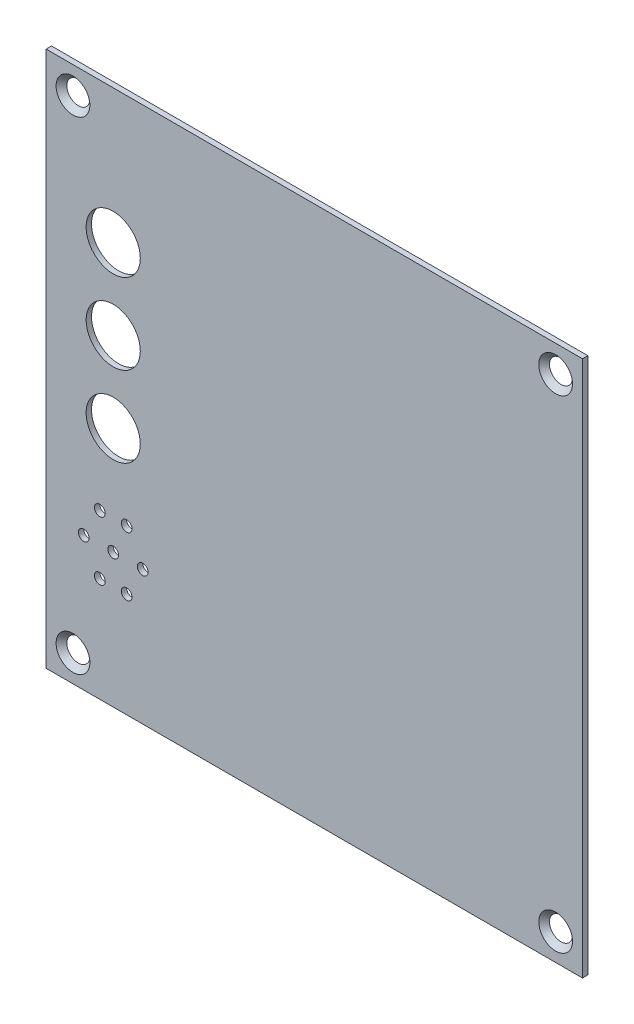
ISO-10303-21;
HEADER;
FILE_DESCRIPTION(('STEP AP214'),'2;1');
FILE_NAME('part.step','',(''),(''),'','','');
FILE_SCHEMA(('AUTOMOTIVE_DESIGN { 1 0 10303 214 1 1 1 1 }'));
ENDSEC;
DATA;
#1=APPLICATION_CONTEXT('core data for automotive mechanical design processes');
#2=APPLICATION_PROTOCOL_DEFINITION('international standard','automotive_design',2000,#1);
#3=PRODUCT_CONTEXT('',#1,'mechanical');
#4=PRODUCT('Part','Part','',(#3));
#5=PRODUCT_RELATED_PRODUCT_CATEGORY('part','',(#4));
#6=PRODUCT_DEFINITION_FORMATION('','',#4);
#7=PRODUCT_DEFINITION_CONTEXT('part definition',#1,'design');
#8=PRODUCT_DEFINITION('design','',#6,#7);
#9=PRODUCT_DEFINITION_SHAPE('','',#8);
#10=(LENGTH_UNIT() NAMED_UNIT(*) SI_UNIT(.MILLI.,.METRE.));
#11=(NAMED_UNIT(*) PLANE_ANGLE_UNIT() SI_UNIT($,.RADIAN.));
#12=(NAMED_UNIT(*) SI_UNIT($,.STERADIAN.) SOLID_ANGLE_UNIT());
#13=UNCERTAINTY_MEASURE_WITH_UNIT(LENGTH_MEASURE(1.E-05),#10,'distance_accuracy_value','');
#14=(GEOMETRIC_REPRESENTATION_CONTEXT(3) GLOBAL_UNCERTAINTY_ASSIGNED_CONTEXT((#13)) GLOBAL_UNIT_ASSIGNED_CONTEXT((#10,
#11,#12)) REPRESENTATION_CONTEXT('',''));
#15=CARTESIAN_POINT('',(0.,0.,0.));
#16=DIRECTION('',(0.,0.,1.));
#17=DIRECTION('',(1.,0.,0.));
#18=AXIS2_PLACEMENT_3D('',#15,#16,#17);
#19=CARTESIAN_POINT('',(0.,0.,0.));
#20=DIRECTION('',(0.,0.,-1.));
#21=DIRECTION('',(-1.,0.,0.));
#22=AXIS2_PLACEMENT_3D('',#19,#20,#21);
#23=PLANE('',#22);
#24=CARTESIAN_POINT('',(12.5,75.,0.));
#25=DIRECTION('',(0.,0.,1.));
#26=DIRECTION('',(1.,0.,0.));
#27=AXIS2_PLACEMENT_3D('',#24,#25,#26);
#28=CIRCLE('',#27,5.05);
#29=CARTESIAN_POINT('',(17.55,75.,0.));
#30=VERTEX_POINT('',#29);
#31=EDGE_CURVE('E132',#30,#30,#28,.T.);
#32=ORIENTED_EDGE('',*,*,#31,.T.);
#33=EDGE_LOOP('',(#32));
#34=FACE_BOUND('',#33,.T.);
#35=CARTESIAN_POINT('',(18.,25.,0.));
#36=DIRECTION('',(0.,0.,1.));
#37=DIRECTION('',(1.,0.,0.));
#38=AXIS2_PLACEMENT_3D('',#35,#36,#37);
#39=CIRCLE('',#38,1.);
#40=CARTESIAN_POINT('',(19.,25.,0.));
#41=VERTEX_POINT('',#40);
#42=EDGE_CURVE('E158',#41,#41,#39,.T.);
#43=ORIENTED_EDGE('',*,*,#42,.T.);
#44=EDGE_LOOP('',(#43));
#45=FACE_BOUND('',#44,.T.);
#46=CARTESIAN_POINT('',(9.99999999999999,30.5,0.));
#47=DIRECTION('',(0.,0.,1.));
#48=DIRECTION('',(1.,0.,0.));
#49=AXIS2_PLACEMENT_3D('',#46,#47,#48);
#50=CIRCLE('',#49,1.);
#51=CARTESIAN_POINT('',(11.,30.5,0.));
#52=VERTEX_POINT('',#51);
#53=EDGE_CURVE('E169',#52,#52,#50,.T.);
#54=ORIENTED_EDGE('',*,*,#53,.T.);
#55=EDGE_LOOP('',(#54));
#56=FACE_BOUND('',#55,.T.);
#57=CARTESIAN_POINT('',(15.,30.5,0.));
#58=DIRECTION('',(0.,0.,1.));
#59=DIRECTION('',(1.,0.,0.));
#60=AXIS2_PLACEMENT_3D('',#57,#58,#59);
#61=CIRCLE('',#60,1.);
#62=CARTESIAN_POINT('',(16.,30.5,0.));
#63=VERTEX_POINT('',#62);
#64=EDGE_CURVE('E170',#63,#63,#61,.T.);
#65=ORIENTED_EDGE('',*,*,#64,.T.);
#66=EDGE_LOOP('',(#65));
#67=FACE_BOUND('',#66,.T.);
#68=CARTESIAN_POINT('',(15.,19.5,0.));
#69=DIRECTION('',(0.,0.,1.));
#70=DIRECTION('',(1.,0.,0.));
#71=AXIS2_PLACEMENT_3D('',#68,#69,#70);
#72=CIRCLE('',#71,1.);
#73=CARTESIAN_POINT('',(16.,19.5,0.));
#74=VERTEX_POINT('',#73);
#75=EDGE_CURVE('E180',#74,#74,#72,.T.);
#76=ORIENTED_EDGE('',*,*,#75,.T.);
#77=EDGE_LOOP('',(#76));
#78=FACE_BOUND('',#77,.T.);
#79=CARTESIAN_POINT('',(12.5,45.,0.));
#80=DIRECTION('',(0.,0.,1.));
#81=DIRECTION('',(1.,0.,0.));
#82=AXIS2_PLACEMENT_3D('',#79,#80,#81);
#83=CIRCLE('',#82,5.05);
#84=CARTESIAN_POINT('',(17.55,45.,0.));
#85=VERTEX_POINT('',#84);
#86=EDGE_CURVE('E150',#85,#85,#83,.T.);
#87=ORIENTED_EDGE('',*,*,#86,.T.);
#88=EDGE_LOOP('',(#87));
#89=FACE_BOUND('',#88,.T.);
#90=CARTESIAN_POINT('',(12.5,25.,0.));
#91=DIRECTION('',(0.,0.,1.));
#92=DIRECTION('',(1.,0.,0.));
#93=AXIS2_PLACEMENT_3D('',#90,#91,#92);
#94=CIRCLE('',#93,1.);
#95=CARTESIAN_POINT('',(13.5,25.,0.));
#96=VERTEX_POINT('',#95);
#97=EDGE_CURVE('E143',#96,#96,#94,.T.);
#98=ORIENTED_EDGE('',*,*,#97,.T.);
#99=EDGE_LOOP('',(#98));
#100=FACE_BOUND('',#99,.T.);
#101=CARTESIAN_POINT('',(9.99999999999999,19.5,0.));
#102=DIRECTION('',(0.,0.,1.));
#103=DIRECTION('',(1.,0.,0.));
#104=AXIS2_PLACEMENT_3D('',#101,#102,#103);
#105=CIRCLE('',#104,1.);
#106=CARTESIAN_POINT('',(11.,19.5,0.));
#107=VERTEX_POINT('',#106);
#108=EDGE_CURVE('E144',#107,#107,#105,.T.);
#109=ORIENTED_EDGE('',*,*,#108,.T.);
#110=EDGE_LOOP('',(#109));
#111=FACE_BOUND('',#110,.T.);
#112=CARTESIAN_POINT('',(6.99999999999999,25.,0.));
#113=DIRECTION('',(0.,0.,1.));
#114=DIRECTION('',(1.,0.,0.));
#115=AXIS2_PLACEMENT_3D('',#112,#113,#114);
#116=CIRCLE('',#115,1.);
#117=CARTESIAN_POINT('',(7.99999999999999,25.,0.));
#118=VERTEX_POINT('',#117);
#119=EDGE_CURVE('E157',#118,#118,#116,.T.);
#120=ORIENTED_EDGE('',*,*,#119,.T.);
#121=EDGE_LOOP('',(#120));
#122=FACE_BOUND('',#121,.T.);
#123=CARTESIAN_POINT('',(12.5,60.,0.));
#124=DIRECTION('',(0.,0.,1.));
#125=DIRECTION('',(1.,0.,0.));
#126=AXIS2_PLACEMENT_3D('',#123,#124,#125);
#127=CIRCLE('',#126,5.05);
#128=CARTESIAN_POINT('',(17.55,60.,0.));
#129=VERTEX_POINT('',#128);
#130=EDGE_CURVE('E136',#129,#129,#127,.T.);
#131=ORIENTED_EDGE('',*,*,#130,.T.);
#132=EDGE_LOOP('',(#131));
#133=FACE_BOUND('',#132,.T.);
#134=CARTESIAN_POINT('',(4.99999999999999,95.,0.));
#135=DIRECTION('',(0.,0.,-1.));
#136=DIRECTION('',(-1.,0.,0.));
#137=AXIS2_PLACEMENT_3D('',#134,#135,#136);
#138=CIRCLE('',#137,2.15);
#139=CARTESIAN_POINT('',(2.84999999999999,95.,0.));
#140=VERTEX_POINT('',#139);
#141=EDGE_CURVE('E126',#140,#140,#138,.T.);
#142=ORIENTED_EDGE('',*,*,#141,.F.);
#143=EDGE_LOOP('',(#142));
#144=FACE_BOUND('',#143,.T.);
#145=CARTESIAN_POINT('',(95.,5.,0.));
#146=DIRECTION('',(0.,0.,-1.));
#147=DIRECTION('',(-1.,0.,0.));
#148=AXIS2_PLACEMENT_3D('',#145,#146,#147);
#149=CIRCLE('',#148,2.15);
#150=CARTESIAN_POINT('',(92.85,5.,0.));
#151=VERTEX_POINT('',#150);
#152=EDGE_CURVE('E110',#151,#151,#149,.T.);
#153=ORIENTED_EDGE('',*,*,#152,.F.);
#154=EDGE_LOOP('',(#153));
#155=FACE_BOUND('',#154,.T.);
#156=CARTESIAN_POINT('',(5.,5.,0.));
#157=DIRECTION('',(0.,0.,-1.));
#158=DIRECTION('',(-1.,0.,0.));
#159=AXIS2_PLACEMENT_3D('',#156,#157,#158);
#160=CIRCLE('',#159,2.15);
#161=CARTESIAN_POINT('',(2.85,5.,0.));
#162=VERTEX_POINT('',#161);
#163=EDGE_CURVE('E102',#162,#162,#160,.T.);
#164=ORIENTED_EDGE('',*,*,#163,.F.);
#165=EDGE_LOOP('',(#164));
#166=FACE_BOUND('',#165,.T.);
#167=DIRECTION('',(0.,-1.,0.));
#168=VECTOR('',#167,1.);
#169=CARTESIAN_POINT('',(0.,0.,0.));
#170=LINE('',#169,#168);
#171=CARTESIAN_POINT('',(0.,100.,0.));
#172=VERTEX_POINT('',#171);
#173=CARTESIAN_POINT('',(0.,0.,0.));
#174=VERTEX_POINT('',#173);
#175=EDGE_CURVE('E99',#172,#174,#170,.T.);
#176=ORIENTED_EDGE('',*,*,#175,.F.);
#177=DIRECTION('',(-1.,0.,0.));
#178=VECTOR('',#177,1.);
#179=CARTESIAN_POINT('',(0.,100.,0.));
#180=LINE('',#179,#178);
#181=CARTESIAN_POINT('',(100.,100.,0.));
#182=VERTEX_POINT('',#181);
#183=EDGE_CURVE('E74',#182,#172,#180,.T.);
#184=ORIENTED_EDGE('',*,*,#183,.F.);
#185=DIRECTION('',(0.,1.,0.));
#186=VECTOR('',#185,1.);
#187=CARTESIAN_POINT('',(100.,0.,0.));
#188=LINE('',#187,#186);
#189=CARTESIAN_POINT('',(100.,0.,0.));
#190=VERTEX_POINT('',#189);
#191=EDGE_CURVE('E68',#190,#182,#188,.T.);
#192=ORIENTED_EDGE('',*,*,#191,.F.);
#193=DIRECTION('',(1.,0.,0.));
#194=VECTOR('',#193,1.);
#195=CARTESIAN_POINT('',(0.,0.,0.));
#196=LINE('',#195,#194);
#197=EDGE_CURVE('E90',#174,#190,#196,.T.);
#198=ORIENTED_EDGE('',*,*,#197,.F.);
#199=EDGE_LOOP('',(#176,#184,#192,#198));
#200=FACE_BOUND('',#199,.T.);
#201=CARTESIAN_POINT('',(95.,95.,0.));
#202=DIRECTION('',(0.,0.,-1.));
#203=DIRECTION('',(-1.,0.,0.));
#204=AXIS2_PLACEMENT_3D('',#201,#202,#203);
#205=CIRCLE('',#204,2.15);
#206=CARTESIAN_POINT('',(92.85,95.,0.));
#207=VERTEX_POINT('',#206);
#208=EDGE_CURVE('E36',#207,#207,#205,.T.);
#209=ORIENTED_EDGE('',*,*,#208,.F.);
#210=EDGE_LOOP('',(#209));
#211=FACE_BOUND('',#210,.T.);
#212=ADVANCED_FACE('F32',(#34,#45,#56,#67,#78,#89,#100,#111,#122,#133,#144,#155,#166,#200,#211),
#23,.T.);
#213=CARTESIAN_POINT('',(0.,0.,1.));
#214=DIRECTION('',(1.,0.,0.));
#215=DIRECTION('',(0.,1.,0.));
#216=AXIS2_PLACEMENT_3D('',#213,#214,#215);
#217=PLANE('',#216);
#218=ORIENTED_EDGE('',*,*,#175,.T.);
#219=DIRECTION('',(0.,0.,-1.));
#220=VECTOR('',#219,1.);
#221=CARTESIAN_POINT('',(0.,0.,1.));
#222=LINE('',#221,#220);
#223=CARTESIAN_POINT('',(0.,0.,1.));
#224=VERTEX_POINT('',#223);
#225=EDGE_CURVE('E11',#224,#174,#222,.T.);
#226=ORIENTED_EDGE('',*,*,#225,.F.);
#227=DIRECTION('',(0.,-1.,0.));
#228=VECTOR('',#227,1.);
#229=CARTESIAN_POINT('',(0.,0.,1.));
#230=LINE('',#229,#228);
#231=CARTESIAN_POINT('',(0.,100.,1.));
#232=VERTEX_POINT('',#231);
#233=EDGE_CURVE('E86',#232,#224,#230,.T.);
#234=ORIENTED_EDGE('',*,*,#233,.F.);
#235=DIRECTION('',(0.,0.,-1.));
#236=VECTOR('',#235,1.);
#237=CARTESIAN_POINT('',(0.,100.,1.));
#238=LINE('',#237,#236);
#239=EDGE_CURVE('E95',#232,#172,#238,.T.);
#240=ORIENTED_EDGE('',*,*,#239,.T.);
#241=EDGE_LOOP('',(#218,#226,#234,#240));
#242=FACE_BOUND('',#241,.T.);
#243=ADVANCED_FACE('F34',(#242),#217,.F.);
#244=CARTESIAN_POINT('',(0.,0.,1.));
#245=DIRECTION('',(0.,1.,0.));
#246=DIRECTION('',(0.,0.,1.));
#247=AXIS2_PLACEMENT_3D('',#244,#245,#246);
#248=PLANE('',#247);
#249=ORIENTED_EDGE('',*,*,#197,.T.);
#250=DIRECTION('',(0.,0.,-1.));
#251=VECTOR('',#250,1.);
#252=CARTESIAN_POINT('',(100.,0.,1.));
#253=LINE('',#252,#251);
#254=CARTESIAN_POINT('',(100.,0.,1.));
#255=VERTEX_POINT('',#254);
#256=EDGE_CURVE('E42',#255,#190,#253,.T.);
#257=ORIENTED_EDGE('',*,*,#256,.F.);
#258=DIRECTION('',(1.,0.,0.));
#259=VECTOR('',#258,1.);
#260=CARTESIAN_POINT('',(0.,0.,1.));
#261=LINE('',#260,#259);
#262=EDGE_CURVE('E81',#224,#255,#261,.T.);
#263=ORIENTED_EDGE('',*,*,#262,.F.);
#264=ORIENTED_EDGE('',*,*,#225,.T.);
#265=EDGE_LOOP('',(#249,#257,#263,#264));
#266=FACE_BOUND('',#265,.T.);
#267=ADVANCED_FACE('F89',(#266),#248,.F.);
#268=CARTESIAN_POINT('',(100.,0.,1.));
#269=DIRECTION('',(-1.,0.,0.));
#270=DIRECTION('',(0.,-1.,0.));
#271=AXIS2_PLACEMENT_3D('',#268,#269,#270);
#272=PLANE('',#271);
#273=ORIENTED_EDGE('',*,*,#191,.T.);
#274=DIRECTION('',(0.,0.,-1.));
#275=VECTOR('',#274,1.);
#276=CARTESIAN_POINT('',(100.,100.,1.));
#277=LINE('',#276,#275);
#278=CARTESIAN_POINT('',(100.,100.,1.));
#279=VERTEX_POINT('',#278);
#280=EDGE_CURVE('E91',#279,#182,#277,.T.);
#281=ORIENTED_EDGE('',*,*,#280,.F.);
#282=DIRECTION('',(0.,1.,0.));
#283=VECTOR('',#282,1.);
#284=CARTESIAN_POINT('',(100.,0.,1.));
#285=LINE('',#284,#283);
#286=EDGE_CURVE('E84',#255,#279,#285,.T.);
#287=ORIENTED_EDGE('',*,*,#286,.F.);
#288=ORIENTED_EDGE('',*,*,#256,.T.);
#289=EDGE_LOOP('',(#273,#281,#287,#288));
#290=FACE_BOUND('',#289,.T.);
#291=ADVANCED_FACE('F93',(#290),#272,.F.);
#292=CARTESIAN_POINT('',(0.,100.,1.));
#293=DIRECTION('',(0.,-1.,0.));
#294=DIRECTION('',(0.,0.,-1.));
#295=AXIS2_PLACEMENT_3D('',#292,#293,#294);
#296=PLANE('',#295);
#297=ORIENTED_EDGE('',*,*,#183,.T.);
#298=ORIENTED_EDGE('',*,*,#239,.F.);
#299=DIRECTION('',(-1.,0.,0.));
#300=VECTOR('',#299,1.);
#301=CARTESIAN_POINT('',(0.,100.,1.));
#302=LINE('',#301,#300);
#303=EDGE_CURVE('E51',#279,#232,#302,.T.);
#304=ORIENTED_EDGE('',*,*,#303,.F.);
#305=ORIENTED_EDGE('',*,*,#280,.T.);
#306=EDGE_LOOP('',(#297,#298,#304,#305));
#307=FACE_BOUND('',#306,.T.);
#308=ADVANCED_FACE('F205',(#307),#296,.F.);
#309=CARTESIAN_POINT('',(0.,0.,1.));
#310=DIRECTION('',(0.,0.,-1.));
#311=DIRECTION('',(-1.,0.,0.));
#312=AXIS2_PLACEMENT_3D('',#309,#310,#311);
#313=PLANE('',#312);
#314=CARTESIAN_POINT('',(12.5,75.,1.));
#315=DIRECTION('',(0.,0.,1.));
#316=DIRECTION('',(1.,0.,0.));
#317=AXIS2_PLACEMENT_3D('',#314,#315,#316);
#318=CIRCLE('',#317,5.05);
#319=CARTESIAN_POINT('',(17.55,75.,1.));
#320=VERTEX_POINT('',#319);
#321=EDGE_CURVE('E153',#320,#320,#318,.T.);
#322=ORIENTED_EDGE('',*,*,#321,.F.);
#323=EDGE_LOOP('',(#322));
#324=FACE_BOUND('',#323,.T.);
#325=CARTESIAN_POINT('',(18.,25.,1.));
#326=DIRECTION('',(0.,0.,1.));
#327=DIRECTION('',(1.,0.,0.));
#328=AXIS2_PLACEMENT_3D('',#325,#326,#327);
#329=CIRCLE('',#328,1.);
#330=CARTESIAN_POINT('',(19.,25.,1.));
#331=VERTEX_POINT('',#330);
#332=EDGE_CURVE('E173',#331,#331,#329,.T.);
#333=ORIENTED_EDGE('',*,*,#332,.F.);
#334=EDGE_LOOP('',(#333));
#335=FACE_BOUND('',#334,.T.);
#336=CARTESIAN_POINT('',(9.99999999999999,30.5,1.));
#337=DIRECTION('',(0.,0.,1.));
#338=DIRECTION('',(1.,0.,0.));
#339=AXIS2_PLACEMENT_3D('',#336,#337,#338);
#340=CIRCLE('',#339,1.);
#341=CARTESIAN_POINT('',(11.,30.5,1.));
#342=VERTEX_POINT('',#341);
#343=EDGE_CURVE('E166',#342,#342,#340,.T.);
#344=ORIENTED_EDGE('',*,*,#343,.F.);
#345=EDGE_LOOP('',(#344));
#346=FACE_BOUND('',#345,.T.);
#347=CARTESIAN_POINT('',(15.,30.5,1.));
#348=DIRECTION('',(0.,0.,1.));
#349=DIRECTION('',(1.,0.,0.));
#350=AXIS2_PLACEMENT_3D('',#347,#348,#349);
#351=CIRCLE('',#350,1.);
#352=CARTESIAN_POINT('',(16.,30.5,1.));
#353=VERTEX_POINT('',#352);
#354=EDGE_CURVE('E183',#353,#353,#351,.T.);
#355=ORIENTED_EDGE('',*,*,#354,.F.);
#356=EDGE_LOOP('',(#355));
#357=FACE_BOUND('',#356,.T.);
#358=CARTESIAN_POINT('',(15.,19.5,1.));
#359=DIRECTION('',(0.,0.,1.));
#360=DIRECTION('',(1.,0.,0.));
#361=AXIS2_PLACEMENT_3D('',#358,#359,#360);
#362=CIRCLE('',#361,1.);
#363=CARTESIAN_POINT('',(16.,19.5,1.));
#364=VERTEX_POINT('',#363);
#365=EDGE_CURVE('E139',#364,#364,#362,.T.);
#366=ORIENTED_EDGE('',*,*,#365,.F.);
#367=EDGE_LOOP('',(#366));
#368=FACE_BOUND('',#367,.T.);
#369=CARTESIAN_POINT('',(12.5,45.,1.));
#370=DIRECTION('',(0.,0.,1.));
#371=DIRECTION('',(1.,0.,0.));
#372=AXIS2_PLACEMENT_3D('',#369,#370,#371);
#373=CIRCLE('',#372,5.05);
#374=CARTESIAN_POINT('',(17.55,45.,1.));
#375=VERTEX_POINT('',#374);
#376=EDGE_CURVE('E147',#375,#375,#373,.T.);
#377=ORIENTED_EDGE('',*,*,#376,.F.);
#378=EDGE_LOOP('',(#377));
#379=FACE_BOUND('',#378,.T.);
#380=CARTESIAN_POINT('',(12.5,25.,1.));
#381=DIRECTION('',(0.,0.,1.));
#382=DIRECTION('',(1.,0.,0.));
#383=AXIS2_PLACEMENT_3D('',#380,#381,#382);
#384=CIRCLE('',#383,1.);
#385=CARTESIAN_POINT('',(13.5,25.,1.));
#386=VERTEX_POINT('',#385);
#387=EDGE_CURVE('E140',#386,#386,#384,.T.);
#388=ORIENTED_EDGE('',*,*,#387,.F.);
#389=EDGE_LOOP('',(#388));
#390=FACE_BOUND('',#389,.T.);
#391=CARTESIAN_POINT('',(9.99999999999999,19.5,1.));
#392=DIRECTION('',(0.,0.,1.));
#393=DIRECTION('',(1.,0.,0.));
#394=AXIS2_PLACEMENT_3D('',#391,#392,#393);
#395=CIRCLE('',#394,1.);
#396=CARTESIAN_POINT('',(11.,19.5,1.));
#397=VERTEX_POINT('',#396);
#398=EDGE_CURVE('E161',#397,#397,#395,.T.);
#399=ORIENTED_EDGE('',*,*,#398,.F.);
#400=EDGE_LOOP('',(#399));
#401=FACE_BOUND('',#400,.T.);
#402=CARTESIAN_POINT('',(6.99999999999999,25.,1.));
#403=DIRECTION('',(0.,0.,1.));
#404=DIRECTION('',(1.,0.,0.));
#405=AXIS2_PLACEMENT_3D('',#402,#403,#404);
#406=CIRCLE('',#405,1.);
#407=CARTESIAN_POINT('',(7.99999999999999,25.,1.));
#408=VERTEX_POINT('',#407);
#409=EDGE_CURVE('E154',#408,#408,#406,.T.);
#410=ORIENTED_EDGE('',*,*,#409,.F.);
#411=EDGE_LOOP('',(#410));
#412=FACE_BOUND('',#411,.T.);
#413=CARTESIAN_POINT('',(12.5,60.,1.));
#414=DIRECTION('',(0.,0.,1.));
#415=DIRECTION('',(1.,0.,0.));
#416=AXIS2_PLACEMENT_3D('',#413,#414,#415);
#417=CIRCLE('',#416,5.05);
#418=CARTESIAN_POINT('',(17.55,60.,1.));
#419=VERTEX_POINT('',#418);
#420=EDGE_CURVE('E133',#419,#419,#417,.T.);
#421=ORIENTED_EDGE('',*,*,#420,.F.);
#422=EDGE_LOOP('',(#421));
#423=FACE_BOUND('',#422,.T.);
#424=CARTESIAN_POINT('',(4.99999999999999,95.,1.));
#425=DIRECTION('',(0.,0.,1.));
#426=DIRECTION('',(1.,0.,0.));
#427=AXIS2_PLACEMENT_3D('',#424,#425,#426);
#428=CIRCLE('',#427,3.15);
#429=CARTESIAN_POINT('',(8.14999999999999,95.,1.));
#430=VERTEX_POINT('',#429);
#431=EDGE_CURVE('E129',#430,#430,#428,.T.);
#432=ORIENTED_EDGE('',*,*,#431,.F.);
#433=EDGE_LOOP('',(#432));
#434=FACE_BOUND('',#433,.T.);
#435=CARTESIAN_POINT('',(95.,95.,1.));
#436=DIRECTION('',(0.,0.,1.));
#437=DIRECTION('',(1.,0.,0.));
#438=AXIS2_PLACEMENT_3D('',#435,#436,#437);
#439=CIRCLE('',#438,3.15);
#440=CARTESIAN_POINT('',(98.15,95.,1.));
#441=VERTEX_POINT('',#440);
#442=EDGE_CURVE('E122',#441,#441,#439,.T.);
#443=ORIENTED_EDGE('',*,*,#442,.F.);
#444=EDGE_LOOP('',(#443));
#445=FACE_BOUND('',#444,.T.);
#446=CARTESIAN_POINT('',(95.,5.,1.));
#447=DIRECTION('',(0.,0.,1.));
#448=DIRECTION('',(1.,0.,0.));
#449=AXIS2_PLACEMENT_3D('',#446,#447,#448);
#450=CIRCLE('',#449,3.15);
#451=CARTESIAN_POINT('',(98.15,5.,1.));
#452=VERTEX_POINT('',#451);
#453=EDGE_CURVE('E112',#452,#452,#450,.T.);
#454=ORIENTED_EDGE('',*,*,#453,.F.);
#455=EDGE_LOOP('',(#454));
#456=FACE_BOUND('',#455,.T.);
#457=CARTESIAN_POINT('',(5.,5.,1.));
#458=DIRECTION('',(0.,0.,1.));
#459=DIRECTION('',(1.,0.,0.));
#460=AXIS2_PLACEMENT_3D('',#457,#458,#459);
#461=CIRCLE('',#460,3.15);
#462=CARTESIAN_POINT('',(8.15,5.,1.));
#463=VERTEX_POINT('',#462);
#464=EDGE_CURVE('E109',#463,#463,#461,.T.);
#465=ORIENTED_EDGE('',*,*,#464,.F.);
#466=EDGE_LOOP('',(#465));
#467=FACE_BOUND('',#466,.T.);
#468=ORIENTED_EDGE('',*,*,#233,.T.);
#469=ORIENTED_EDGE('',*,*,#262,.T.);
#470=ORIENTED_EDGE('',*,*,#286,.T.);
#471=ORIENTED_EDGE('',*,*,#303,.T.);
#472=EDGE_LOOP('',(#468,#469,#470,#471));
#473=FACE_BOUND('',#472,.T.);
#474=ADVANCED_FACE('F82',(#324,#335,#346,#357,#368,#379,#390,#401,#412,#423,#434,#445,#456,#467,
#473),#313,.F.);
#475=CARTESIAN_POINT('',(5.,5.,1.));
#476=DIRECTION('',(0.,0.,1.));
#477=DIRECTION('',(1.,0.,0.));
#478=AXIS2_PLACEMENT_3D('',#475,#476,#477);
#479=CONICAL_SURFACE('',#478,3.15,0.785398163397448);
#480=ORIENTED_EDGE('',*,*,#163,.T.);
#481=EDGE_LOOP('',(#480));
#482=FACE_BOUND('',#481,.T.);
#483=ORIENTED_EDGE('',*,*,#464,.T.);
#484=EDGE_LOOP('',(#483));
#485=FACE_BOUND('',#484,.T.);
#486=ADVANCED_FACE('F204',(#482,#485),#479,.F.);
#487=CARTESIAN_POINT('',(95.,5.,1.));
#488=DIRECTION('',(0.,0.,1.));
#489=DIRECTION('',(1.,0.,0.));
#490=AXIS2_PLACEMENT_3D('',#487,#488,#489);
#491=CONICAL_SURFACE('',#490,3.15,0.78539816339745);
#492=ORIENTED_EDGE('',*,*,#152,.T.);
#493=EDGE_LOOP('',(#492));
#494=FACE_BOUND('',#493,.T.);
#495=ORIENTED_EDGE('',*,*,#453,.T.);
#496=EDGE_LOOP('',(#495));
#497=FACE_BOUND('',#496,.T.);
#498=ADVANCED_FACE('F233',(#494,#497),#491,.F.);
#499=CARTESIAN_POINT('',(95.,95.,1.));
#500=DIRECTION('',(0.,0.,1.));
#501=DIRECTION('',(1.,0.,0.));
#502=AXIS2_PLACEMENT_3D('',#499,#500,#501);
#503=CONICAL_SURFACE('',#502,3.15,0.78539816339745);
#504=ORIENTED_EDGE('',*,*,#208,.T.);
#505=EDGE_LOOP('',(#504));
#506=FACE_BOUND('',#505,.T.);
#507=ORIENTED_EDGE('',*,*,#442,.T.);
#508=EDGE_LOOP('',(#507));
#509=FACE_BOUND('',#508,.T.);
#510=ADVANCED_FACE('F239',(#506,#509),#503,.F.);
#511=CARTESIAN_POINT('',(4.99999999999999,95.,1.));
#512=DIRECTION('',(0.,0.,1.));
#513=DIRECTION('',(1.,0.,0.));
#514=AXIS2_PLACEMENT_3D('',#511,#512,#513);
#515=CONICAL_SURFACE('',#514,3.15,0.785398163397448);
#516=ORIENTED_EDGE('',*,*,#141,.T.);
#517=EDGE_LOOP('',(#516));
#518=FACE_BOUND('',#517,.T.);
#519=ORIENTED_EDGE('',*,*,#431,.T.);
#520=EDGE_LOOP('',(#519));
#521=FACE_BOUND('',#520,.T.);
#522=ADVANCED_FACE('F282',(#518,#521),#515,.F.);
#523=CARTESIAN_POINT('',(12.5,60.,0.));
#524=DIRECTION('',(0.,0.,1.));
#525=DIRECTION('',(1.,0.,0.));
#526=AXIS2_PLACEMENT_3D('',#523,#524,#525);
#527=CYLINDRICAL_SURFACE('',#526,5.05);
#528=ORIENTED_EDGE('',*,*,#130,.F.);
#529=EDGE_LOOP('',(#528));
#530=FACE_BOUND('',#529,.T.);
#531=ORIENTED_EDGE('',*,*,#420,.T.);
#532=EDGE_LOOP('',(#531));
#533=FACE_BOUND('',#532,.T.);
#534=ADVANCED_FACE('F276',(#530,#533),#527,.F.);
#535=CARTESIAN_POINT('',(6.99999999999999,25.,0.));
#536=DIRECTION('',(0.,0.,1.));
#537=DIRECTION('',(1.,0.,0.));
#538=AXIS2_PLACEMENT_3D('',#535,#536,#537);
#539=CYLINDRICAL_SURFACE('',#538,1.);
#540=ORIENTED_EDGE('',*,*,#119,.F.);
#541=EDGE_LOOP('',(#540));
#542=FACE_BOUND('',#541,.T.);
#543=ORIENTED_EDGE('',*,*,#409,.T.);
#544=EDGE_LOOP('',(#543));
#545=FACE_BOUND('',#544,.T.);
#546=ADVANCED_FACE('F281',(#542,#545),#539,.F.);
#547=CARTESIAN_POINT('',(9.99999999999999,19.5,0.));
#548=DIRECTION('',(0.,0.,1.));
#549=DIRECTION('',(1.,0.,0.));
#550=AXIS2_PLACEMENT_3D('',#547,#548,#549);
#551=CYLINDRICAL_SURFACE('',#550,1.);
#552=ORIENTED_EDGE('',*,*,#108,.F.);
#553=EDGE_LOOP('',(#552));
#554=FACE_BOUND('',#553,.T.);
#555=ORIENTED_EDGE('',*,*,#398,.T.);
#556=EDGE_LOOP('',(#555));
#557=FACE_BOUND('',#556,.T.);
#558=ADVANCED_FACE('F294',(#554,#557),#551,.F.);
#559=CARTESIAN_POINT('',(12.5,25.,0.));
#560=DIRECTION('',(0.,0.,1.));
#561=DIRECTION('',(1.,0.,0.));
#562=AXIS2_PLACEMENT_3D('',#559,#560,#561);
#563=CYLINDRICAL_SURFACE('',#562,1.);
#564=ORIENTED_EDGE('',*,*,#97,.F.);
#565=EDGE_LOOP('',(#564));
#566=FACE_BOUND('',#565,.T.);
#567=ORIENTED_EDGE('',*,*,#387,.T.);
#568=EDGE_LOOP('',(#567));
#569=FACE_BOUND('',#568,.T.);
#570=ADVANCED_FACE('F304',(#566,#569),#563,.F.);
#571=CARTESIAN_POINT('',(12.5,45.,0.));
#572=DIRECTION('',(0.,0.,1.));
#573=DIRECTION('',(1.,0.,0.));
#574=AXIS2_PLACEMENT_3D('',#571,#572,#573);
#575=CYLINDRICAL_SURFACE('',#574,5.05);
#576=ORIENTED_EDGE('',*,*,#86,.F.);
#577=EDGE_LOOP('',(#576));
#578=FACE_BOUND('',#577,.T.);
#579=ORIENTED_EDGE('',*,*,#376,.T.);
#580=EDGE_LOOP('',(#579));
#581=FACE_BOUND('',#580,.T.);
#582=ADVANCED_FACE('F314',(#578,#581),#575,.F.);
#583=CARTESIAN_POINT('',(15.,19.5,0.));
#584=DIRECTION('',(0.,0.,1.));
#585=DIRECTION('',(1.,0.,0.));
#586=AXIS2_PLACEMENT_3D('',#583,#584,#585);
#587=CYLINDRICAL_SURFACE('',#586,1.);
#588=ORIENTED_EDGE('',*,*,#75,.F.);
#589=EDGE_LOOP('',(#588));
#590=FACE_BOUND('',#589,.T.);
#591=ORIENTED_EDGE('',*,*,#365,.T.);
#592=EDGE_LOOP('',(#591));
#593=FACE_BOUND('',#592,.T.);
#594=ADVANCED_FACE('F324',(#590,#593),#587,.F.);
#595=CARTESIAN_POINT('',(15.,30.5,0.));
#596=DIRECTION('',(0.,0.,1.));
#597=DIRECTION('',(1.,0.,0.));
#598=AXIS2_PLACEMENT_3D('',#595,#596,#597);
#599=CYLINDRICAL_SURFACE('',#598,1.);
#600=ORIENTED_EDGE('',*,*,#64,.F.);
#601=EDGE_LOOP('',(#600));
#602=FACE_BOUND('',#601,.T.);
#603=ORIENTED_EDGE('',*,*,#354,.T.);
#604=EDGE_LOOP('',(#603));
#605=FACE_BOUND('',#604,.T.);
#606=ADVANCED_FACE('F334',(#602,#605),#599,.F.);
#607=CARTESIAN_POINT('',(9.99999999999999,30.5,0.));
#608=DIRECTION('',(0.,0.,1.));
#609=DIRECTION('',(1.,0.,0.));
#610=AXIS2_PLACEMENT_3D('',#607,#608,#609);
#611=CYLINDRICAL_SURFACE('',#610,1.);
#612=ORIENTED_EDGE('',*,*,#53,.F.);
#613=EDGE_LOOP('',(#612));
#614=FACE_BOUND('',#613,.T.);
#615=ORIENTED_EDGE('',*,*,#343,.T.);
#616=EDGE_LOOP('',(#615));
#617=FACE_BOUND('',#616,.T.);
#618=ADVANCED_FACE('F344',(#614,#617),#611,.F.);
#619=CARTESIAN_POINT('',(18.,25.,0.));
#620=DIRECTION('',(0.,0.,1.));
#621=DIRECTION('',(1.,0.,0.));
#622=AXIS2_PLACEMENT_3D('',#619,#620,#621);
#623=CYLINDRICAL_SURFACE('',#622,1.);
#624=ORIENTED_EDGE('',*,*,#42,.F.);
#625=EDGE_LOOP('',(#624));
#626=FACE_BOUND('',#625,.T.);
#627=ORIENTED_EDGE('',*,*,#332,.T.);
#628=EDGE_LOOP('',(#627));
#629=FACE_BOUND('',#628,.T.);
#630=ADVANCED_FACE('F198',(#626,#629),#623,.F.);
#631=CARTESIAN_POINT('',(12.5,75.,0.));
#632=DIRECTION('',(0.,0.,1.));
#633=DIRECTION('',(1.,0.,0.));
#634=AXIS2_PLACEMENT_3D('',#631,#632,#633);
#635=CYLINDRICAL_SURFACE('',#634,5.05);
#636=ORIENTED_EDGE('',*,*,#31,.F.);
#637=EDGE_LOOP('',(#636));
#638=FACE_BOUND('',#637,.T.);
#639=ORIENTED_EDGE('',*,*,#321,.T.);
#640=EDGE_LOOP('',(#639));
#641=FACE_BOUND('',#640,.T.);
#642=ADVANCED_FACE('F195',(#638,#641),#635,.F.);
#643=CLOSED_SHELL('',(#212,#243,#267,#291,#308,#474,#486,#498,#510,#522,#534,#546,#558,#570,
#582,#594,#606,#618,#630,#642));
#644=MANIFOLD_SOLID_BREP('B2',#643);
#645=ADVANCED_BREP_SHAPE_REPRESENTATION('',(#18,#644),#14);
#646=SHAPE_DEFINITION_REPRESENTATION(#9,#645);
ENDSEC;
END-ISO-10303-21;
